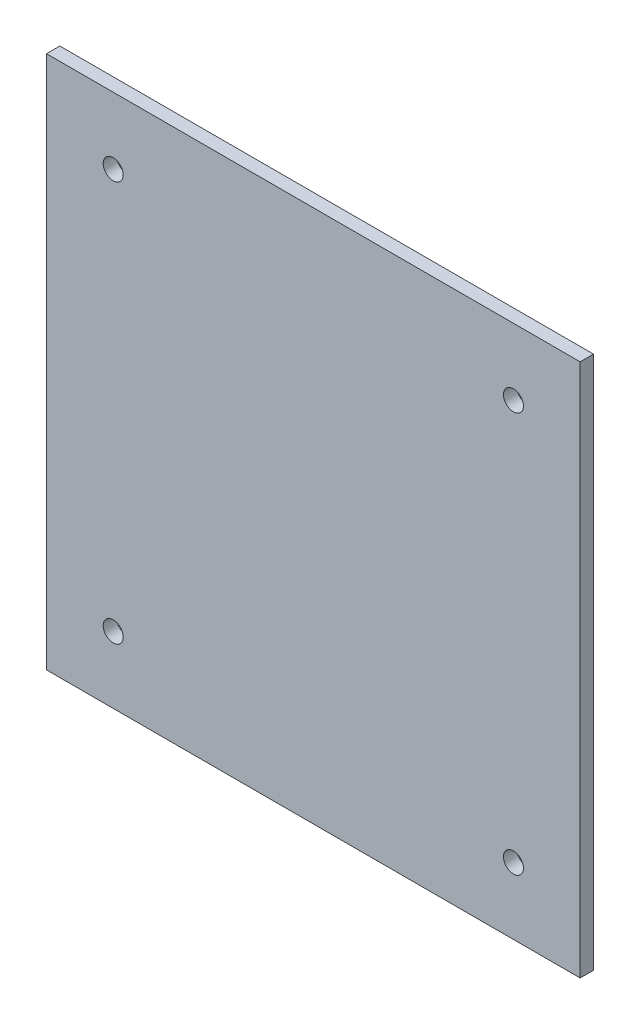
ISO-10303-21;
HEADER;
FILE_DESCRIPTION(('STEP AP214'),'2;1');
FILE_NAME('part.step','',(''),(''),'','','');
FILE_SCHEMA(('AUTOMOTIVE_DESIGN { 1 0 10303 214 1 1 1 1 }'));
ENDSEC;
DATA;
#1=APPLICATION_CONTEXT('core data for automotive mechanical design processes');
#2=APPLICATION_PROTOCOL_DEFINITION('international standard','automotive_design',2000,#1);
#3=PRODUCT_CONTEXT('',#1,'mechanical');
#4=PRODUCT('Part','Part','',(#3));
#5=PRODUCT_RELATED_PRODUCT_CATEGORY('part','',(#4));
#6=PRODUCT_DEFINITION_FORMATION('','',#4);
#7=PRODUCT_DEFINITION_CONTEXT('part definition',#1,'design');
#8=PRODUCT_DEFINITION('design','',#6,#7);
#9=PRODUCT_DEFINITION_SHAPE('','',#8);
#10=(LENGTH_UNIT() NAMED_UNIT(*) SI_UNIT(.MILLI.,.METRE.));
#11=(NAMED_UNIT(*) PLANE_ANGLE_UNIT() SI_UNIT($,.RADIAN.));
#12=(NAMED_UNIT(*) SI_UNIT($,.STERADIAN.) SOLID_ANGLE_UNIT());
#13=UNCERTAINTY_MEASURE_WITH_UNIT(LENGTH_MEASURE(1.E-05),#10,'distance_accuracy_value','');
#14=(GEOMETRIC_REPRESENTATION_CONTEXT(3) GLOBAL_UNCERTAINTY_ASSIGNED_CONTEXT((#13)) GLOBAL_UNIT_ASSIGNED_CONTEXT((#10,
#11,#12)) REPRESENTATION_CONTEXT('',''));
#15=CARTESIAN_POINT('',(0.,0.,0.));
#16=DIRECTION('',(0.,0.,1.));
#17=DIRECTION('',(1.,0.,0.));
#18=AXIS2_PLACEMENT_3D('',#15,#16,#17);
#19=CARTESIAN_POINT('',(80.,0.,2.));
#20=DIRECTION('',(0.,1.,0.));
#21=DIRECTION('',(0.,0.,1.));
#22=AXIS2_PLACEMENT_3D('',#19,#20,#21);
#23=PLANE('',#22);
#24=DIRECTION('',(1.,0.,0.));
#25=VECTOR('',#24,1.);
#26=CARTESIAN_POINT('',(80.,0.,0.));
#27=LINE('',#26,#25);
#28=CARTESIAN_POINT('',(0.,0.,0.));
#29=VERTEX_POINT('',#28);
#30=CARTESIAN_POINT('',(80.,0.,0.));
#31=VERTEX_POINT('',#30);
#32=EDGE_CURVE('E99',#29,#31,#27,.T.);
#33=ORIENTED_EDGE('',*,*,#32,.T.);
#34=DIRECTION('',(0.,0.,-1.));
#35=VECTOR('',#34,1.);
#36=CARTESIAN_POINT('',(80.,0.,2.));
#37=LINE('',#36,#35);
#38=CARTESIAN_POINT('',(80.,0.,2.));
#39=VERTEX_POINT('',#38);
#40=EDGE_CURVE('E11',#39,#31,#37,.T.);
#41=ORIENTED_EDGE('',*,*,#40,.F.);
#42=DIRECTION('',(1.,0.,0.));
#43=VECTOR('',#42,1.);
#44=CARTESIAN_POINT('',(80.,0.,2.));
#45=LINE('',#44,#43);
#46=CARTESIAN_POINT('',(0.,0.,2.));
#47=VERTEX_POINT('',#46);
#48=EDGE_CURVE('E87',#47,#39,#45,.T.);
#49=ORIENTED_EDGE('',*,*,#48,.F.);
#50=DIRECTION('',(0.,0.,-1.));
#51=VECTOR('',#50,1.);
#52=CARTESIAN_POINT('',(0.,0.,2.));
#53=LINE('',#52,#51);
#54=EDGE_CURVE('E95',#47,#29,#53,.T.);
#55=ORIENTED_EDGE('',*,*,#54,.T.);
#56=EDGE_LOOP('',(#33,#41,#49,#55));
#57=FACE_BOUND('',#56,.T.);
#58=ADVANCED_FACE('F36',(#57),#23,.F.);
#59=CARTESIAN_POINT('',(80.,80.,2.));
#60=DIRECTION('',(-1.,0.,0.));
#61=DIRECTION('',(0.,-1.,0.));
#62=AXIS2_PLACEMENT_3D('',#59,#60,#61);
#63=PLANE('',#62);
#64=DIRECTION('',(0.,1.,0.));
#65=VECTOR('',#64,1.);
#66=CARTESIAN_POINT('',(80.,80.,0.));
#67=LINE('',#66,#65);
#68=CARTESIAN_POINT('',(80.,80.,0.));
#69=VERTEX_POINT('',#68);
#70=EDGE_CURVE('E91',#31,#69,#67,.T.);
#71=ORIENTED_EDGE('',*,*,#70,.T.);
#72=DIRECTION('',(0.,0.,-1.));
#73=VECTOR('',#72,1.);
#74=CARTESIAN_POINT('',(80.,80.,2.));
#75=LINE('',#74,#73);
#76=CARTESIAN_POINT('',(80.,80.,2.));
#77=VERTEX_POINT('',#76);
#78=EDGE_CURVE('E44',#77,#69,#75,.T.);
#79=ORIENTED_EDGE('',*,*,#78,.F.);
#80=DIRECTION('',(0.,1.,0.));
#81=VECTOR('',#80,1.);
#82=CARTESIAN_POINT('',(80.,80.,2.));
#83=LINE('',#82,#81);
#84=EDGE_CURVE('E82',#39,#77,#83,.T.);
#85=ORIENTED_EDGE('',*,*,#84,.F.);
#86=ORIENTED_EDGE('',*,*,#40,.T.);
#87=EDGE_LOOP('',(#71,#79,#85,#86));
#88=FACE_BOUND('',#87,.T.);
#89=ADVANCED_FACE('F90',(#88),#63,.F.);
#90=CARTESIAN_POINT('',(0.,80.,2.));
#91=DIRECTION('',(0.,-1.,0.));
#92=DIRECTION('',(0.,0.,-1.));
#93=AXIS2_PLACEMENT_3D('',#90,#91,#92);
#94=PLANE('',#93);
#95=DIRECTION('',(-1.,0.,0.));
#96=VECTOR('',#95,1.);
#97=CARTESIAN_POINT('',(0.,80.,0.));
#98=LINE('',#97,#96);
#99=CARTESIAN_POINT('',(0.,80.,0.));
#100=VERTEX_POINT('',#99);
#101=EDGE_CURVE('E69',#69,#100,#98,.T.);
#102=ORIENTED_EDGE('',*,*,#101,.T.);
#103=DIRECTION('',(0.,0.,-1.));
#104=VECTOR('',#103,1.);
#105=CARTESIAN_POINT('',(0.,80.,2.));
#106=LINE('',#105,#104);
#107=CARTESIAN_POINT('',(0.,80.,2.));
#108=VERTEX_POINT('',#107);
#109=EDGE_CURVE('E92',#108,#100,#106,.T.);
#110=ORIENTED_EDGE('',*,*,#109,.F.);
#111=DIRECTION('',(-1.,0.,0.));
#112=VECTOR('',#111,1.);
#113=CARTESIAN_POINT('',(0.,80.,2.));
#114=LINE('',#113,#112);
#115=EDGE_CURVE('E85',#77,#108,#114,.T.);
#116=ORIENTED_EDGE('',*,*,#115,.F.);
#117=ORIENTED_EDGE('',*,*,#78,.T.);
#118=EDGE_LOOP('',(#102,#110,#116,#117));
#119=FACE_BOUND('',#118,.T.);
#120=ADVANCED_FACE('F93',(#119),#94,.F.);
#121=CARTESIAN_POINT('',(0.,0.,2.));
#122=DIRECTION('',(1.,0.,0.));
#123=DIRECTION('',(0.,0.,-1.));
#124=AXIS2_PLACEMENT_3D('',#121,#122,#123);
#125=PLANE('',#124);
#126=DIRECTION('',(0.,-1.,0.));
#127=VECTOR('',#126,1.);
#128=CARTESIAN_POINT('',(0.,0.,0.));
#129=LINE('',#128,#127);
#130=EDGE_CURVE('E75',#100,#29,#129,.T.);
#131=ORIENTED_EDGE('',*,*,#130,.T.);
#132=ORIENTED_EDGE('',*,*,#54,.F.);
#133=DIRECTION('',(0.,-1.,0.));
#134=VECTOR('',#133,1.);
#135=CARTESIAN_POINT('',(0.,0.,2.));
#136=LINE('',#135,#134);
#137=EDGE_CURVE('E52',#108,#47,#136,.T.);
#138=ORIENTED_EDGE('',*,*,#137,.F.);
#139=ORIENTED_EDGE('',*,*,#109,.T.);
#140=EDGE_LOOP('',(#131,#132,#138,#139));
#141=FACE_BOUND('',#140,.T.);
#142=ADVANCED_FACE('F107',(#141),#125,.F.);
#143=CARTESIAN_POINT('',(0.,0.,2.));
#144=DIRECTION('',(0.,0.,-1.));
#145=DIRECTION('',(-1.,0.,0.));
#146=AXIS2_PLACEMENT_3D('',#143,#144,#145);
#147=PLANE('',#146);
#148=CARTESIAN_POINT('',(10.,10.,2.));
#149=DIRECTION('',(0.,0.,-1.));
#150=DIRECTION('',(-1.,0.,0.));
#151=AXIS2_PLACEMENT_3D('',#148,#149,#150);
#152=CIRCLE('',#151,1.5);
#153=CARTESIAN_POINT('',(8.50000000000001,10.,2.));
#154=VERTEX_POINT('',#153);
#155=EDGE_CURVE('E102',#154,#154,#152,.T.);
#156=ORIENTED_EDGE('',*,*,#155,.T.);
#157=EDGE_LOOP('',(#156));
#158=FACE_BOUND('',#157,.T.);
#159=CARTESIAN_POINT('',(10.0000000000002,70.,2.));
#160=DIRECTION('',(0.,0.,-1.));
#161=DIRECTION('',(-1.,0.,0.));
#162=AXIS2_PLACEMENT_3D('',#159,#160,#161);
#163=CIRCLE('',#162,1.5);
#164=CARTESIAN_POINT('',(8.50000000000022,70.,2.));
#165=VERTEX_POINT('',#164);
#166=EDGE_CURVE('E115',#165,#165,#163,.T.);
#167=ORIENTED_EDGE('',*,*,#166,.T.);
#168=EDGE_LOOP('',(#167));
#169=FACE_BOUND('',#168,.T.);
#170=CARTESIAN_POINT('',(70.0000000000002,70.,2.));
#171=DIRECTION('',(0.,0.,-1.));
#172=DIRECTION('',(-1.,0.,0.));
#173=AXIS2_PLACEMENT_3D('',#170,#171,#172);
#174=CIRCLE('',#173,1.5);
#175=CARTESIAN_POINT('',(68.5000000000002,70.,2.));
#176=VERTEX_POINT('',#175);
#177=EDGE_CURVE('E118',#176,#176,#174,.T.);
#178=ORIENTED_EDGE('',*,*,#177,.T.);
#179=EDGE_LOOP('',(#178));
#180=FACE_BOUND('',#179,.T.);
#181=CARTESIAN_POINT('',(70.,10.,2.));
#182=DIRECTION('',(0.,0.,-1.));
#183=DIRECTION('',(-1.,0.,0.));
#184=AXIS2_PLACEMENT_3D('',#181,#182,#183);
#185=CIRCLE('',#184,1.5);
#186=CARTESIAN_POINT('',(68.5,10.,2.));
#187=VERTEX_POINT('',#186);
#188=EDGE_CURVE('E121',#187,#187,#185,.T.);
#189=ORIENTED_EDGE('',*,*,#188,.T.);
#190=EDGE_LOOP('',(#189));
#191=FACE_BOUND('',#190,.T.);
#192=ORIENTED_EDGE('',*,*,#48,.T.);
#193=ORIENTED_EDGE('',*,*,#84,.T.);
#194=ORIENTED_EDGE('',*,*,#115,.T.);
#195=ORIENTED_EDGE('',*,*,#137,.T.);
#196=EDGE_LOOP('',(#192,#193,#194,#195));
#197=FACE_BOUND('',#196,.T.);
#198=ADVANCED_FACE('F83',(#158,#169,#180,#191,#197),#147,.F.);
#199=CARTESIAN_POINT('',(0.,0.,0.));
#200=DIRECTION('',(0.,0.,-1.));
#201=DIRECTION('',(-1.,0.,0.));
#202=AXIS2_PLACEMENT_3D('',#199,#200,#201);
#203=PLANE('',#202);
#204=CARTESIAN_POINT('',(10.,10.,0.));
#205=DIRECTION('',(0.,0.,-1.));
#206=DIRECTION('',(-1.,0.,0.));
#207=AXIS2_PLACEMENT_3D('',#204,#205,#206);
#208=CIRCLE('',#207,1.5);
#209=CARTESIAN_POINT('',(8.50000000000001,10.,0.));
#210=VERTEX_POINT('',#209);
#211=EDGE_CURVE('E128',#210,#210,#208,.T.);
#212=ORIENTED_EDGE('',*,*,#211,.F.);
#213=EDGE_LOOP('',(#212));
#214=FACE_BOUND('',#213,.T.);
#215=CARTESIAN_POINT('',(10.0000000000002,70.,0.));
#216=DIRECTION('',(0.,0.,-1.));
#217=DIRECTION('',(-1.,0.,0.));
#218=AXIS2_PLACEMENT_3D('',#215,#216,#217);
#219=CIRCLE('',#218,1.5);
#220=CARTESIAN_POINT('',(8.50000000000022,70.,0.));
#221=VERTEX_POINT('',#220);
#222=EDGE_CURVE('E131',#221,#221,#219,.T.);
#223=ORIENTED_EDGE('',*,*,#222,.F.);
#224=EDGE_LOOP('',(#223));
#225=FACE_BOUND('',#224,.T.);
#226=CARTESIAN_POINT('',(70.0000000000002,70.,0.));
#227=DIRECTION('',(0.,0.,-1.));
#228=DIRECTION('',(-1.,0.,0.));
#229=AXIS2_PLACEMENT_3D('',#226,#227,#228);
#230=CIRCLE('',#229,1.5);
#231=CARTESIAN_POINT('',(68.5000000000002,70.,0.));
#232=VERTEX_POINT('',#231);
#233=EDGE_CURVE('E127',#232,#232,#230,.T.);
#234=ORIENTED_EDGE('',*,*,#233,.F.);
#235=EDGE_LOOP('',(#234));
#236=FACE_BOUND('',#235,.T.);
#237=CARTESIAN_POINT('',(70.,10.,0.));
#238=DIRECTION('',(0.,0.,-1.));
#239=DIRECTION('',(-1.,0.,0.));
#240=AXIS2_PLACEMENT_3D('',#237,#238,#239);
#241=CIRCLE('',#240,1.5);
#242=CARTESIAN_POINT('',(68.5,10.,0.));
#243=VERTEX_POINT('',#242);
#244=EDGE_CURVE('E124',#243,#243,#241,.T.);
#245=ORIENTED_EDGE('',*,*,#244,.F.);
#246=EDGE_LOOP('',(#245));
#247=FACE_BOUND('',#246,.T.);
#248=ORIENTED_EDGE('',*,*,#32,.F.);
#249=ORIENTED_EDGE('',*,*,#130,.F.);
#250=ORIENTED_EDGE('',*,*,#101,.F.);
#251=ORIENTED_EDGE('',*,*,#70,.F.);
#252=EDGE_LOOP('',(#248,#249,#250,#251));
#253=FACE_BOUND('',#252,.T.);
#254=ADVANCED_FACE('F110',(#214,#225,#236,#247,#253),#203,.T.);
#255=CARTESIAN_POINT('',(70.,10.,10.));
#256=DIRECTION('',(0.,0.,-1.));
#257=DIRECTION('',(-1.,0.,0.));
#258=AXIS2_PLACEMENT_3D('',#255,#256,#257);
#259=CYLINDRICAL_SURFACE('',#258,1.5);
#260=ORIENTED_EDGE('',*,*,#244,.T.);
#261=EDGE_LOOP('',(#260));
#262=FACE_BOUND('',#261,.T.);
#263=ORIENTED_EDGE('',*,*,#188,.F.);
#264=EDGE_LOOP('',(#263));
#265=FACE_BOUND('',#264,.T.);
#266=ADVANCED_FACE('F142',(#262,#265),#259,.F.);
#267=CARTESIAN_POINT('',(70.0000000000002,70.,10.));
#268=DIRECTION('',(0.,0.,-1.));
#269=DIRECTION('',(-1.,0.,0.));
#270=AXIS2_PLACEMENT_3D('',#267,#268,#269);
#271=CYLINDRICAL_SURFACE('',#270,1.5);
#272=ORIENTED_EDGE('',*,*,#233,.T.);
#273=EDGE_LOOP('',(#272));
#274=FACE_BOUND('',#273,.T.);
#275=ORIENTED_EDGE('',*,*,#177,.F.);
#276=EDGE_LOOP('',(#275));
#277=FACE_BOUND('',#276,.T.);
#278=ADVANCED_FACE('F137',(#274,#277),#271,.F.);
#279=CARTESIAN_POINT('',(10.0000000000002,70.,10.));
#280=DIRECTION('',(0.,0.,-1.));
#281=DIRECTION('',(-1.,0.,0.));
#282=AXIS2_PLACEMENT_3D('',#279,#280,#281);
#283=CYLINDRICAL_SURFACE('',#282,1.5);
#284=ORIENTED_EDGE('',*,*,#222,.T.);
#285=EDGE_LOOP('',(#284));
#286=FACE_BOUND('',#285,.T.);
#287=ORIENTED_EDGE('',*,*,#166,.F.);
#288=EDGE_LOOP('',(#287));
#289=FACE_BOUND('',#288,.T.);
#290=ADVANCED_FACE('F199',(#286,#289),#283,.F.);
#291=CARTESIAN_POINT('',(10.,10.,10.));
#292=DIRECTION('',(0.,0.,-1.));
#293=DIRECTION('',(-1.,0.,0.));
#294=AXIS2_PLACEMENT_3D('',#291,#292,#293);
#295=CYLINDRICAL_SURFACE('',#294,1.5);
#296=ORIENTED_EDGE('',*,*,#211,.T.);
#297=EDGE_LOOP('',(#296));
#298=FACE_BOUND('',#297,.T.);
#299=ORIENTED_EDGE('',*,*,#155,.F.);
#300=EDGE_LOOP('',(#299));
#301=FACE_BOUND('',#300,.T.);
#302=ADVANCED_FACE('F208',(#298,#301),#295,.F.);
#303=CLOSED_SHELL('',(#58,#89,#120,#142,#198,#254,#266,#278,#290,#302));
#304=MANIFOLD_SOLID_BREP('B2',#303);
#305=ADVANCED_BREP_SHAPE_REPRESENTATION('',(#18,#304),#14);
#306=SHAPE_DEFINITION_REPRESENTATION(#9,#305);
ENDSEC;
END-ISO-10303-21;
